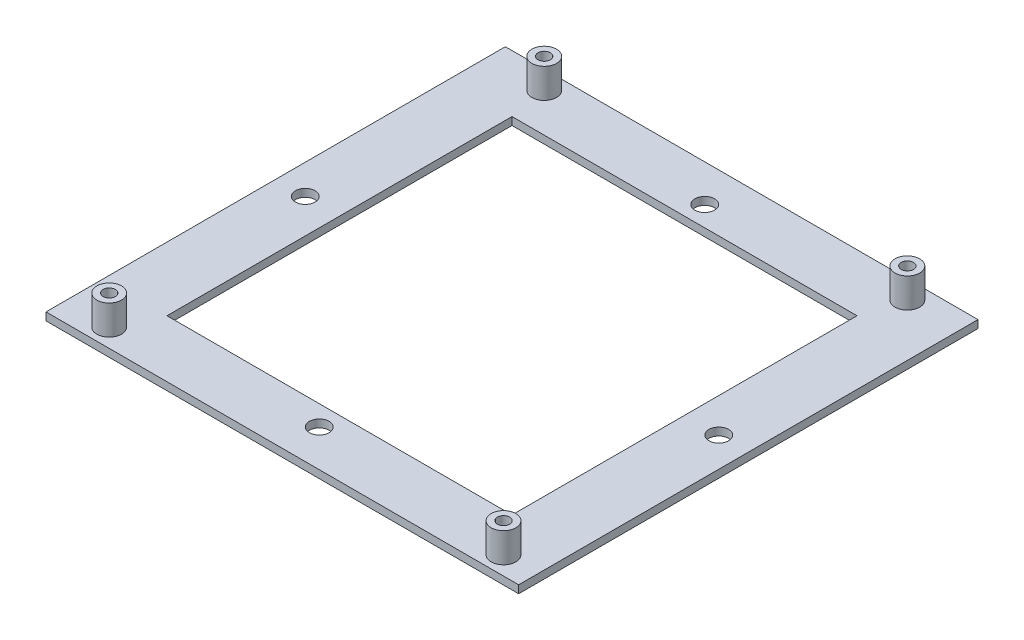
ISO-10303-21;
HEADER;
FILE_DESCRIPTION(('STEP AP214'),'2;1');
FILE_NAME('part.step','',(''),(''),'','','');
FILE_SCHEMA(('AUTOMOTIVE_DESIGN { 1 0 10303 214 1 1 1 1 }'));
ENDSEC;
DATA;
#1=APPLICATION_CONTEXT('core data for automotive mechanical design processes');
#2=APPLICATION_PROTOCOL_DEFINITION('international standard','automotive_design',2000,#1);
#3=PRODUCT_CONTEXT('',#1,'mechanical');
#4=PRODUCT('Part','Part','',(#3));
#5=PRODUCT_RELATED_PRODUCT_CATEGORY('part','',(#4));
#6=PRODUCT_DEFINITION_FORMATION('','',#4);
#7=PRODUCT_DEFINITION_CONTEXT('part definition',#1,'design');
#8=PRODUCT_DEFINITION('design','',#6,#7);
#9=PRODUCT_DEFINITION_SHAPE('','',#8);
#10=(LENGTH_UNIT() NAMED_UNIT(*) SI_UNIT(.MILLI.,.METRE.));
#11=(NAMED_UNIT(*) PLANE_ANGLE_UNIT() SI_UNIT($,.RADIAN.));
#12=(NAMED_UNIT(*) SI_UNIT($,.STERADIAN.) SOLID_ANGLE_UNIT());
#13=UNCERTAINTY_MEASURE_WITH_UNIT(LENGTH_MEASURE(1.E-05),#10,'distance_accuracy_value','');
#14=(GEOMETRIC_REPRESENTATION_CONTEXT(3) GLOBAL_UNCERTAINTY_ASSIGNED_CONTEXT((#13)) GLOBAL_UNIT_ASSIGNED_CONTEXT((#10,
#11,#12)) REPRESENTATION_CONTEXT('',''));
#15=CARTESIAN_POINT('',(0.,0.,0.));
#16=DIRECTION('',(0.,0.,1.));
#17=DIRECTION('',(1.,0.,0.));
#18=AXIS2_PLACEMENT_3D('',#15,#16,#17);
#19=CARTESIAN_POINT('',(0.,1.58,0.));
#20=DIRECTION('',(0.,-1.,0.));
#21=DIRECTION('',(0.,0.,-1.));
#22=AXIS2_PLACEMENT_3D('',#19,#20,#21);
#23=PLANE('',#22);
#24=CARTESIAN_POINT('',(41.145,1.58,42.8625));
#25=DIRECTION('',(0.,-1.,0.));
#26=DIRECTION('',(0.,0.,-1.));
#27=AXIS2_PLACEMENT_3D('',#24,#25,#26);
#28=CIRCLE('',#27,2.5);
#29=CARTESIAN_POINT('',(41.145,1.58,40.3625));
#30=VERTEX_POINT('',#29);
#31=EDGE_CURVE('E11',#30,#30,#28,.F.);
#32=ORIENTED_EDGE('',*,*,#31,.F.);
#33=EDGE_LOOP('',(#32));
#34=FACE_BOUND('',#33,.T.);
#35=CARTESIAN_POINT('',(-38.865,1.58,42.8625));
#36=DIRECTION('',(0.,-1.,0.));
#37=DIRECTION('',(0.,0.,-1.));
#38=AXIS2_PLACEMENT_3D('',#35,#36,#37);
#39=CIRCLE('',#38,2.5);
#40=CARTESIAN_POINT('',(-38.865,1.58,40.3625));
#41=VERTEX_POINT('',#40);
#42=EDGE_CURVE('E46',#41,#41,#39,.F.);
#43=ORIENTED_EDGE('',*,*,#42,.F.);
#44=EDGE_LOOP('',(#43));
#45=FACE_BOUND('',#44,.T.);
#46=CARTESIAN_POINT('',(-36.325,1.58,-42.8625));
#47=DIRECTION('',(0.,-1.,0.));
#48=DIRECTION('',(0.,0.,-1.));
#49=AXIS2_PLACEMENT_3D('',#46,#47,#48);
#50=CIRCLE('',#49,2.5);
#51=CARTESIAN_POINT('',(-36.325,1.58,-45.3625));
#52=VERTEX_POINT('',#51);
#53=EDGE_CURVE('E242',#52,#52,#50,.F.);
#54=ORIENTED_EDGE('',*,*,#53,.F.);
#55=EDGE_LOOP('',(#54));
#56=FACE_BOUND('',#55,.T.);
#57=CARTESIAN_POINT('',(37.355,1.58,-42.8635));
#58=DIRECTION('',(0.,-1.,0.));
#59=DIRECTION('',(0.,0.,-1.));
#60=AXIS2_PLACEMENT_3D('',#57,#58,#59);
#61=CIRCLE('',#60,2.5);
#62=CARTESIAN_POINT('',(37.355,1.58,-45.3635));
#63=VERTEX_POINT('',#62);
#64=EDGE_CURVE('E239',#63,#63,#61,.F.);
#65=ORIENTED_EDGE('',*,*,#64,.F.);
#66=EDGE_LOOP('',(#65));
#67=FACE_BOUND('',#66,.T.);
#68=DIRECTION('',(0.,0.,-1.));
#69=VECTOR('',#68,1.);
#70=CARTESIAN_POINT('',(47.95,1.58,46.6));
#71=LINE('',#70,#69);
#72=CARTESIAN_POINT('',(47.95,1.58,46.6));
#73=VERTEX_POINT('',#72);
#74=CARTESIAN_POINT('',(47.95,1.58,-46.6));
#75=VERTEX_POINT('',#74);
#76=EDGE_CURVE('E210',#73,#75,#71,.T.);
#77=ORIENTED_EDGE('',*,*,#76,.T.);
#78=DIRECTION('',(-1.,0.,0.));
#79=VECTOR('',#78,1.);
#80=CARTESIAN_POINT('',(-47.95,1.58,-46.6));
#81=LINE('',#80,#79);
#82=CARTESIAN_POINT('',(-47.95,1.58,-46.6));
#83=VERTEX_POINT('',#82);
#84=EDGE_CURVE('E213',#75,#83,#81,.T.);
#85=ORIENTED_EDGE('',*,*,#84,.T.);
#86=DIRECTION('',(0.,0.,1.));
#87=VECTOR('',#86,1.);
#88=CARTESIAN_POINT('',(-47.95,1.58,46.6));
#89=LINE('',#88,#87);
#90=CARTESIAN_POINT('',(-47.95,1.58,46.6));
#91=VERTEX_POINT('',#90);
#92=EDGE_CURVE('E216',#83,#91,#89,.T.);
#93=ORIENTED_EDGE('',*,*,#92,.T.);
#94=DIRECTION('',(1.,0.,0.));
#95=VECTOR('',#94,1.);
#96=CARTESIAN_POINT('',(-47.95,1.58,46.6));
#97=LINE('',#96,#95);
#98=EDGE_CURVE('E218',#91,#73,#97,.T.);
#99=ORIENTED_EDGE('',*,*,#98,.T.);
#100=EDGE_LOOP('',(#77,#85,#93,#99));
#101=FACE_BOUND('',#100,.T.);
#102=DIRECTION('',(0.,0.,-1.));
#103=VECTOR('',#102,1.);
#104=CARTESIAN_POINT('',(35.,1.58,35.));
#105=LINE('',#104,#103);
#106=CARTESIAN_POINT('',(35.,1.58,35.));
#107=VERTEX_POINT('',#106);
#108=CARTESIAN_POINT('',(35.,1.58,-35.));
#109=VERTEX_POINT('',#108);
#110=EDGE_CURVE('E184',#107,#109,#105,.T.);
#111=ORIENTED_EDGE('',*,*,#110,.F.);
#112=DIRECTION('',(1.,0.,0.));
#113=VECTOR('',#112,1.);
#114=CARTESIAN_POINT('',(-35.,1.58,35.));
#115=LINE('',#114,#113);
#116=CARTESIAN_POINT('',(-35.,1.58,35.));
#117=VERTEX_POINT('',#116);
#118=EDGE_CURVE('E191',#117,#107,#115,.T.);
#119=ORIENTED_EDGE('',*,*,#118,.F.);
#120=DIRECTION('',(0.,0.,1.));
#121=VECTOR('',#120,1.);
#122=CARTESIAN_POINT('',(-35.,1.58,35.));
#123=LINE('',#122,#121);
#124=CARTESIAN_POINT('',(-35.,1.58,-35.));
#125=VERTEX_POINT('',#124);
#126=EDGE_CURVE('E189',#125,#117,#123,.T.);
#127=ORIENTED_EDGE('',*,*,#126,.F.);
#128=DIRECTION('',(-1.,0.,0.));
#129=VECTOR('',#128,1.);
#130=CARTESIAN_POINT('',(-35.,1.58,-35.));
#131=LINE('',#130,#129);
#132=EDGE_CURVE('E186',#109,#125,#131,.T.);
#133=ORIENTED_EDGE('',*,*,#132,.F.);
#134=EDGE_LOOP('',(#111,#119,#127,#133));
#135=FACE_BOUND('',#134,.T.);
#136=CARTESIAN_POINT('',(0.,1.58,-39.1));
#137=DIRECTION('',(0.,1.,0.));
#138=DIRECTION('',(0.,0.,1.));
#139=AXIS2_PLACEMENT_3D('',#136,#137,#138);
#140=CIRCLE('',#139,2.);
#141=CARTESIAN_POINT('',(0.,1.58,-37.1));
#142=VERTEX_POINT('',#141);
#143=EDGE_CURVE('E179',#142,#142,#140,.T.);
#144=ORIENTED_EDGE('',*,*,#143,.F.);
#145=EDGE_LOOP('',(#144));
#146=FACE_BOUND('',#145,.T.);
#147=CARTESIAN_POINT('',(41.95,1.58,0.));
#148=DIRECTION('',(0.,1.,0.));
#149=DIRECTION('',(0.,0.,1.));
#150=AXIS2_PLACEMENT_3D('',#147,#148,#149);
#151=CIRCLE('',#150,2.);
#152=CARTESIAN_POINT('',(41.95,1.58,2.));
#153=VERTEX_POINT('',#152);
#154=EDGE_CURVE('E173',#153,#153,#151,.T.);
#155=ORIENTED_EDGE('',*,*,#154,.F.);
#156=EDGE_LOOP('',(#155));
#157=FACE_BOUND('',#156,.T.);
#158=CARTESIAN_POINT('',(0.,1.58,39.1));
#159=DIRECTION('',(0.,1.,0.));
#160=DIRECTION('',(0.,0.,1.));
#161=AXIS2_PLACEMENT_3D('',#158,#159,#160);
#162=CIRCLE('',#161,2.);
#163=CARTESIAN_POINT('',(0.,1.58,41.1));
#164=VERTEX_POINT('',#163);
#165=EDGE_CURVE('E167',#164,#164,#162,.T.);
#166=ORIENTED_EDGE('',*,*,#165,.F.);
#167=EDGE_LOOP('',(#166));
#168=FACE_BOUND('',#167,.T.);
#169=CARTESIAN_POINT('',(-41.95,1.58,0.));
#170=DIRECTION('',(0.,1.,0.));
#171=DIRECTION('',(0.,0.,1.));
#172=AXIS2_PLACEMENT_3D('',#169,#170,#171);
#173=CIRCLE('',#172,2.);
#174=CARTESIAN_POINT('',(-41.95,1.58,2.));
#175=VERTEX_POINT('',#174);
#176=EDGE_CURVE('E161',#175,#175,#173,.T.);
#177=ORIENTED_EDGE('',*,*,#176,.F.);
#178=EDGE_LOOP('',(#177));
#179=FACE_BOUND('',#178,.T.);
#180=ADVANCED_FACE('F38',(#34,#45,#56,#67,#101,#135,#146,#157,#168,#179),#23,.F.);
#181=CARTESIAN_POINT('',(0.,0.,0.));
#182=DIRECTION('',(0.,-1.,0.));
#183=DIRECTION('',(0.,0.,-1.));
#184=AXIS2_PLACEMENT_3D('',#181,#182,#183);
#185=PLANE('',#184);
#186=CARTESIAN_POINT('',(0.,0.,39.1));
#187=DIRECTION('',(0.,1.,0.));
#188=DIRECTION('',(0.,0.,1.));
#189=AXIS2_PLACEMENT_3D('',#186,#187,#188);
#190=CIRCLE('',#189,2.);
#191=CARTESIAN_POINT('',(0.,0.,41.1));
#192=VERTEX_POINT('',#191);
#193=EDGE_CURVE('E164',#192,#192,#190,.T.);
#194=ORIENTED_EDGE('',*,*,#193,.T.);
#195=EDGE_LOOP('',(#194));
#196=FACE_BOUND('',#195,.T.);
#197=CARTESIAN_POINT('',(0.,0.,-39.1));
#198=DIRECTION('',(0.,1.,0.));
#199=DIRECTION('',(0.,0.,1.));
#200=AXIS2_PLACEMENT_3D('',#197,#198,#199);
#201=CIRCLE('',#200,2.);
#202=CARTESIAN_POINT('',(0.,0.,-37.1));
#203=VERTEX_POINT('',#202);
#204=EDGE_CURVE('E176',#203,#203,#201,.T.);
#205=ORIENTED_EDGE('',*,*,#204,.T.);
#206=EDGE_LOOP('',(#205));
#207=FACE_BOUND('',#206,.T.);
#208=DIRECTION('',(0.,0.,-1.));
#209=VECTOR('',#208,1.);
#210=CARTESIAN_POINT('',(47.95,0.,46.6));
#211=LINE('',#210,#209);
#212=CARTESIAN_POINT('',(47.95,0.,46.6));
#213=VERTEX_POINT('',#212);
#214=CARTESIAN_POINT('',(47.95,0.,-46.6));
#215=VERTEX_POINT('',#214);
#216=EDGE_CURVE('E209',#213,#215,#211,.T.);
#217=ORIENTED_EDGE('',*,*,#216,.F.);
#218=DIRECTION('',(1.,0.,0.));
#219=VECTOR('',#218,1.);
#220=CARTESIAN_POINT('',(-47.95,0.,46.6));
#221=LINE('',#220,#219);
#222=CARTESIAN_POINT('',(-47.95,0.,46.6));
#223=VERTEX_POINT('',#222);
#224=EDGE_CURVE('E214',#223,#213,#221,.T.);
#225=ORIENTED_EDGE('',*,*,#224,.F.);
#226=DIRECTION('',(0.,0.,1.));
#227=VECTOR('',#226,1.);
#228=CARTESIAN_POINT('',(-47.95,0.,46.6));
#229=LINE('',#228,#227);
#230=CARTESIAN_POINT('',(-47.95,0.,-46.6));
#231=VERTEX_POINT('',#230);
#232=EDGE_CURVE('E225',#231,#223,#229,.T.);
#233=ORIENTED_EDGE('',*,*,#232,.F.);
#234=DIRECTION('',(-1.,0.,0.));
#235=VECTOR('',#234,1.);
#236=CARTESIAN_POINT('',(-47.95,0.,-46.6));
#237=LINE('',#236,#235);
#238=EDGE_CURVE('E223',#215,#231,#237,.T.);
#239=ORIENTED_EDGE('',*,*,#238,.F.);
#240=EDGE_LOOP('',(#217,#225,#233,#239));
#241=FACE_BOUND('',#240,.T.);
#242=DIRECTION('',(1.,0.,0.));
#243=VECTOR('',#242,1.);
#244=CARTESIAN_POINT('',(-35.,0.,35.));
#245=LINE('',#244,#243);
#246=CARTESIAN_POINT('',(-35.,0.,35.));
#247=VERTEX_POINT('',#246);
#248=CARTESIAN_POINT('',(35.,0.,35.));
#249=VERTEX_POINT('',#248);
#250=EDGE_CURVE('E187',#247,#249,#245,.T.);
#251=ORIENTED_EDGE('',*,*,#250,.T.);
#252=DIRECTION('',(0.,0.,-1.));
#253=VECTOR('',#252,1.);
#254=CARTESIAN_POINT('',(35.,0.,35.));
#255=LINE('',#254,#253);
#256=CARTESIAN_POINT('',(35.,0.,-35.));
#257=VERTEX_POINT('',#256);
#258=EDGE_CURVE('E61',#249,#257,#255,.T.);
#259=ORIENTED_EDGE('',*,*,#258,.T.);
#260=DIRECTION('',(-1.,0.,0.));
#261=VECTOR('',#260,1.);
#262=CARTESIAN_POINT('',(-35.,0.,-35.));
#263=LINE('',#262,#261);
#264=CARTESIAN_POINT('',(-35.,0.,-35.));
#265=VERTEX_POINT('',#264);
#266=EDGE_CURVE('E195',#257,#265,#263,.T.);
#267=ORIENTED_EDGE('',*,*,#266,.T.);
#268=DIRECTION('',(0.,0.,1.));
#269=VECTOR('',#268,1.);
#270=CARTESIAN_POINT('',(-35.,0.,35.));
#271=LINE('',#270,#269);
#272=EDGE_CURVE('E198',#265,#247,#271,.T.);
#273=ORIENTED_EDGE('',*,*,#272,.T.);
#274=EDGE_LOOP('',(#251,#259,#267,#273));
#275=FACE_BOUND('',#274,.T.);
#276=CARTESIAN_POINT('',(41.95,0.,0.));
#277=DIRECTION('',(0.,1.,0.));
#278=DIRECTION('',(0.,0.,1.));
#279=AXIS2_PLACEMENT_3D('',#276,#277,#278);
#280=CIRCLE('',#279,2.);
#281=CARTESIAN_POINT('',(41.95,0.,2.));
#282=VERTEX_POINT('',#281);
#283=EDGE_CURVE('E170',#282,#282,#280,.T.);
#284=ORIENTED_EDGE('',*,*,#283,.T.);
#285=EDGE_LOOP('',(#284));
#286=FACE_BOUND('',#285,.T.);
#287=CARTESIAN_POINT('',(-41.95,0.,0.));
#288=DIRECTION('',(0.,1.,0.));
#289=DIRECTION('',(0.,0.,1.));
#290=AXIS2_PLACEMENT_3D('',#287,#288,#289);
#291=CIRCLE('',#290,2.);
#292=CARTESIAN_POINT('',(-41.95,0.,2.));
#293=VERTEX_POINT('',#292);
#294=EDGE_CURVE('E160',#293,#293,#291,.T.);
#295=ORIENTED_EDGE('',*,*,#294,.T.);
#296=EDGE_LOOP('',(#295));
#297=FACE_BOUND('',#296,.T.);
#298=ADVANCED_FACE('F251',(#196,#207,#241,#275,#286,#297),#185,.T.);
#299=CARTESIAN_POINT('',(47.95,1.58,46.6));
#300=DIRECTION('',(-1.,0.,0.));
#301=DIRECTION('',(0.,0.,1.));
#302=AXIS2_PLACEMENT_3D('',#299,#300,#301);
#303=PLANE('',#302);
#304=ORIENTED_EDGE('',*,*,#216,.T.);
#305=DIRECTION('',(0.,-1.,0.));
#306=VECTOR('',#305,1.);
#307=CARTESIAN_POINT('',(47.95,1.58,-46.6));
#308=LINE('',#307,#306);
#309=EDGE_CURVE('E236',#75,#215,#308,.T.);
#310=ORIENTED_EDGE('',*,*,#309,.F.);
#311=ORIENTED_EDGE('',*,*,#76,.F.);
#312=DIRECTION('',(0.,-1.,0.));
#313=VECTOR('',#312,1.);
#314=CARTESIAN_POINT('',(47.95,1.58,46.6));
#315=LINE('',#314,#313);
#316=EDGE_CURVE('E220',#73,#213,#315,.T.);
#317=ORIENTED_EDGE('',*,*,#316,.T.);
#318=EDGE_LOOP('',(#304,#310,#311,#317));
#319=FACE_BOUND('',#318,.T.);
#320=ADVANCED_FACE('F40',(#319),#303,.F.);
#321=CARTESIAN_POINT('',(-47.95,1.58,-46.6));
#322=DIRECTION('',(0.,0.,1.));
#323=DIRECTION('',(1.,0.,0.));
#324=AXIS2_PLACEMENT_3D('',#321,#322,#323);
#325=PLANE('',#324);
#326=ORIENTED_EDGE('',*,*,#238,.T.);
#327=DIRECTION('',(0.,-1.,0.));
#328=VECTOR('',#327,1.);
#329=CARTESIAN_POINT('',(-47.95,1.58,-46.6));
#330=LINE('',#329,#328);
#331=EDGE_CURVE('E233',#83,#231,#330,.T.);
#332=ORIENTED_EDGE('',*,*,#331,.F.);
#333=ORIENTED_EDGE('',*,*,#84,.F.);
#334=ORIENTED_EDGE('',*,*,#309,.T.);
#335=EDGE_LOOP('',(#326,#332,#333,#334));
#336=FACE_BOUND('',#335,.T.);
#337=ADVANCED_FACE('F287',(#336),#325,.F.);
#338=CARTESIAN_POINT('',(-47.95,1.58,46.6));
#339=DIRECTION('',(1.,0.,0.));
#340=DIRECTION('',(0.,0.,-1.));
#341=AXIS2_PLACEMENT_3D('',#338,#339,#340);
#342=PLANE('',#341);
#343=ORIENTED_EDGE('',*,*,#232,.T.);
#344=DIRECTION('',(0.,-1.,0.));
#345=VECTOR('',#344,1.);
#346=CARTESIAN_POINT('',(-47.95,1.58,46.6));
#347=LINE('',#346,#345);
#348=EDGE_CURVE('E230',#91,#223,#347,.T.);
#349=ORIENTED_EDGE('',*,*,#348,.F.);
#350=ORIENTED_EDGE('',*,*,#92,.F.);
#351=ORIENTED_EDGE('',*,*,#331,.T.);
#352=EDGE_LOOP('',(#343,#349,#350,#351));
#353=FACE_BOUND('',#352,.T.);
#354=ADVANCED_FACE('F296',(#353),#342,.F.);
#355=CARTESIAN_POINT('',(-47.95,1.58,46.6));
#356=DIRECTION('',(0.,0.,-1.));
#357=DIRECTION('',(-1.,0.,0.));
#358=AXIS2_PLACEMENT_3D('',#355,#356,#357);
#359=PLANE('',#358);
#360=ORIENTED_EDGE('',*,*,#224,.T.);
#361=ORIENTED_EDGE('',*,*,#316,.F.);
#362=ORIENTED_EDGE('',*,*,#98,.F.);
#363=ORIENTED_EDGE('',*,*,#348,.T.);
#364=EDGE_LOOP('',(#360,#361,#362,#363));
#365=FACE_BOUND('',#364,.T.);
#366=ADVANCED_FACE('F292',(#365),#359,.F.);
#367=CARTESIAN_POINT('',(35.,1.58,35.));
#368=DIRECTION('',(-1.,0.,0.));
#369=DIRECTION('',(0.,0.,1.));
#370=AXIS2_PLACEMENT_3D('',#367,#368,#369);
#371=PLANE('',#370);
#372=ORIENTED_EDGE('',*,*,#258,.F.);
#373=DIRECTION('',(0.,-1.,0.));
#374=VECTOR('',#373,1.);
#375=CARTESIAN_POINT('',(35.,1.58,35.));
#376=LINE('',#375,#374);
#377=EDGE_CURVE('E193',#107,#249,#376,.T.);
#378=ORIENTED_EDGE('',*,*,#377,.F.);
#379=ORIENTED_EDGE('',*,*,#110,.T.);
#380=DIRECTION('',(0.,-1.,0.));
#381=VECTOR('',#380,1.);
#382=CARTESIAN_POINT('',(35.,1.58,-35.));
#383=LINE('',#382,#381);
#384=EDGE_CURVE('E207',#109,#257,#383,.T.);
#385=ORIENTED_EDGE('',*,*,#384,.T.);
#386=EDGE_LOOP('',(#372,#378,#379,#385));
#387=FACE_BOUND('',#386,.T.);
#388=ADVANCED_FACE('F295',(#387),#371,.T.);
#389=CARTESIAN_POINT('',(-35.,1.58,-35.));
#390=DIRECTION('',(0.,0.,1.));
#391=DIRECTION('',(1.,0.,0.));
#392=AXIS2_PLACEMENT_3D('',#389,#390,#391);
#393=PLANE('',#392);
#394=ORIENTED_EDGE('',*,*,#266,.F.);
#395=ORIENTED_EDGE('',*,*,#384,.F.);
#396=ORIENTED_EDGE('',*,*,#132,.T.);
#397=DIRECTION('',(0.,-1.,0.));
#398=VECTOR('',#397,1.);
#399=CARTESIAN_POINT('',(-35.,1.58,-35.));
#400=LINE('',#399,#398);
#401=EDGE_CURVE('E205',#125,#265,#400,.T.);
#402=ORIENTED_EDGE('',*,*,#401,.T.);
#403=EDGE_LOOP('',(#394,#395,#396,#402));
#404=FACE_BOUND('',#403,.T.);
#405=ADVANCED_FACE('F337',(#404),#393,.T.);
#406=CARTESIAN_POINT('',(-35.,1.58,35.));
#407=DIRECTION('',(1.,0.,0.));
#408=DIRECTION('',(0.,0.,-1.));
#409=AXIS2_PLACEMENT_3D('',#406,#407,#408);
#410=PLANE('',#409);
#411=ORIENTED_EDGE('',*,*,#272,.F.);
#412=ORIENTED_EDGE('',*,*,#401,.F.);
#413=ORIENTED_EDGE('',*,*,#126,.T.);
#414=DIRECTION('',(0.,-1.,0.));
#415=VECTOR('',#414,1.);
#416=CARTESIAN_POINT('',(-35.,1.58,35.));
#417=LINE('',#416,#415);
#418=EDGE_CURVE('E53',#117,#247,#417,.T.);
#419=ORIENTED_EDGE('',*,*,#418,.T.);
#420=EDGE_LOOP('',(#411,#412,#413,#419));
#421=FACE_BOUND('',#420,.T.);
#422=ADVANCED_FACE('F334',(#421),#410,.T.);
#423=CARTESIAN_POINT('',(-35.,1.58,35.));
#424=DIRECTION('',(0.,0.,-1.));
#425=DIRECTION('',(-1.,0.,0.));
#426=AXIS2_PLACEMENT_3D('',#423,#424,#425);
#427=PLANE('',#426);
#428=ORIENTED_EDGE('',*,*,#250,.F.);
#429=ORIENTED_EDGE('',*,*,#418,.F.);
#430=ORIENTED_EDGE('',*,*,#118,.T.);
#431=ORIENTED_EDGE('',*,*,#377,.T.);
#432=EDGE_LOOP('',(#428,#429,#430,#431));
#433=FACE_BOUND('',#432,.T.);
#434=ADVANCED_FACE('F328',(#433),#427,.T.);
#435=CARTESIAN_POINT('',(0.,1.58,-39.1));
#436=DIRECTION('',(0.,-1.,0.));
#437=DIRECTION('',(0.,0.,-1.));
#438=AXIS2_PLACEMENT_3D('',#435,#436,#437);
#439=CYLINDRICAL_SURFACE('',#438,2.);
#440=ORIENTED_EDGE('',*,*,#143,.T.);
#441=EDGE_LOOP('',(#440));
#442=FACE_BOUND('',#441,.T.);
#443=ORIENTED_EDGE('',*,*,#204,.F.);
#444=EDGE_LOOP('',(#443));
#445=FACE_BOUND('',#444,.T.);
#446=ADVANCED_FACE('F319',(#442,#445),#439,.F.);
#447=CARTESIAN_POINT('',(41.95,1.58,0.));
#448=DIRECTION('',(0.,-1.,0.));
#449=DIRECTION('',(0.,0.,-1.));
#450=AXIS2_PLACEMENT_3D('',#447,#448,#449);
#451=CYLINDRICAL_SURFACE('',#450,2.);
#452=ORIENTED_EDGE('',*,*,#154,.T.);
#453=EDGE_LOOP('',(#452));
#454=FACE_BOUND('',#453,.T.);
#455=ORIENTED_EDGE('',*,*,#283,.F.);
#456=EDGE_LOOP('',(#455));
#457=FACE_BOUND('',#456,.T.);
#458=ADVANCED_FACE('F317',(#454,#457),#451,.F.);
#459=CARTESIAN_POINT('',(0.,1.58,39.1));
#460=DIRECTION('',(0.,-1.,0.));
#461=DIRECTION('',(0.,0.,-1.));
#462=AXIS2_PLACEMENT_3D('',#459,#460,#461);
#463=CYLINDRICAL_SURFACE('',#462,2.);
#464=ORIENTED_EDGE('',*,*,#165,.T.);
#465=EDGE_LOOP('',(#464));
#466=FACE_BOUND('',#465,.T.);
#467=ORIENTED_EDGE('',*,*,#193,.F.);
#468=EDGE_LOOP('',(#467));
#469=FACE_BOUND('',#468,.T.);
#470=ADVANCED_FACE('F277',(#466,#469),#463,.F.);
#471=CARTESIAN_POINT('',(-41.95,1.58,0.));
#472=DIRECTION('',(0.,-1.,0.));
#473=DIRECTION('',(0.,0.,-1.));
#474=AXIS2_PLACEMENT_3D('',#471,#472,#473);
#475=CYLINDRICAL_SURFACE('',#474,2.);
#476=ORIENTED_EDGE('',*,*,#176,.T.);
#477=EDGE_LOOP('',(#476));
#478=FACE_BOUND('',#477,.T.);
#479=ORIENTED_EDGE('',*,*,#294,.F.);
#480=EDGE_LOOP('',(#479));
#481=FACE_BOUND('',#480,.T.);
#482=ADVANCED_FACE('F273',(#478,#481),#475,.F.);
#483=CARTESIAN_POINT('',(37.355,7.58,-42.8635));
#484=DIRECTION('',(0.,-1.,0.));
#485=DIRECTION('',(0.,0.,-1.));
#486=AXIS2_PLACEMENT_3D('',#483,#484,#485);
#487=CYLINDRICAL_SURFACE('',#486,2.5);
#488=CARTESIAN_POINT('',(37.355,7.58,-42.8635));
#489=DIRECTION('',(0.,1.,0.));
#490=DIRECTION('',(0.,0.,1.));
#491=AXIS2_PLACEMENT_3D('',#488,#489,#490);
#492=CIRCLE('',#491,2.5);
#493=CARTESIAN_POINT('',(37.355,7.58,-40.3635));
#494=VERTEX_POINT('',#493);
#495=EDGE_CURVE('E157',#494,#494,#492,.T.);
#496=ORIENTED_EDGE('',*,*,#495,.F.);
#497=EDGE_LOOP('',(#496));
#498=FACE_BOUND('',#497,.T.);
#499=ORIENTED_EDGE('',*,*,#64,.T.);
#500=EDGE_LOOP('',(#499));
#501=FACE_BOUND('',#500,.T.);
#502=ADVANCED_FACE('F276',(#498,#501),#487,.T.);
#503=CARTESIAN_POINT('',(37.355,7.58,-42.8635));
#504=DIRECTION('',(0.,1.,0.));
#505=DIRECTION('',(0.,0.,1.));
#506=AXIS2_PLACEMENT_3D('',#503,#504,#505);
#507=PLANE('',#506);
#508=CARTESIAN_POINT('',(37.355,7.58,-42.8635));
#509=DIRECTION('',(0.,1.,0.));
#510=DIRECTION('',(0.,0.,1.));
#511=AXIS2_PLACEMENT_3D('',#508,#509,#510);
#512=CIRCLE('',#511,1.24999999999999);
#513=CARTESIAN_POINT('',(37.355,7.58,-41.6135));
#514=VERTEX_POINT('',#513);
#515=EDGE_CURVE('E142',#514,#514,#512,.T.);
#516=ORIENTED_EDGE('',*,*,#515,.F.);
#517=EDGE_LOOP('',(#516));
#518=FACE_BOUND('',#517,.T.);
#519=ORIENTED_EDGE('',*,*,#495,.T.);
#520=EDGE_LOOP('',(#519));
#521=FACE_BOUND('',#520,.T.);
#522=ADVANCED_FACE('F394',(#518,#521),#507,.T.);
#523=CARTESIAN_POINT('',(-36.325,7.58,-42.8625));
#524=DIRECTION('',(0.,-1.,0.));
#525=DIRECTION('',(0.,0.,-1.));
#526=AXIS2_PLACEMENT_3D('',#523,#524,#525);
#527=CYLINDRICAL_SURFACE('',#526,2.5);
#528=CARTESIAN_POINT('',(-36.325,7.58,-42.8625));
#529=DIRECTION('',(0.,1.,0.));
#530=DIRECTION('',(0.,0.,1.));
#531=AXIS2_PLACEMENT_3D('',#528,#529,#530);
#532=CIRCLE('',#531,2.5);
#533=CARTESIAN_POINT('',(-36.325,7.58,-40.3625));
#534=VERTEX_POINT('',#533);
#535=EDGE_CURVE('E154',#534,#534,#532,.T.);
#536=ORIENTED_EDGE('',*,*,#535,.F.);
#537=EDGE_LOOP('',(#536));
#538=FACE_BOUND('',#537,.T.);
#539=ORIENTED_EDGE('',*,*,#53,.T.);
#540=EDGE_LOOP('',(#539));
#541=FACE_BOUND('',#540,.T.);
#542=ADVANCED_FACE('F402',(#538,#541),#527,.T.);
#543=CARTESIAN_POINT('',(-36.325,7.58,-42.8625));
#544=DIRECTION('',(0.,1.,0.));
#545=DIRECTION('',(0.,0.,1.));
#546=AXIS2_PLACEMENT_3D('',#543,#544,#545);
#547=PLANE('',#546);
#548=CARTESIAN_POINT('',(-36.325,7.58,-42.8625));
#549=DIRECTION('',(0.,1.,0.));
#550=DIRECTION('',(0.,0.,1.));
#551=AXIS2_PLACEMENT_3D('',#548,#549,#550);
#552=CIRCLE('',#551,1.24999999999999);
#553=CARTESIAN_POINT('',(-36.325,7.58,-41.6125));
#554=VERTEX_POINT('',#553);
#555=EDGE_CURVE('E126',#554,#554,#552,.T.);
#556=ORIENTED_EDGE('',*,*,#555,.F.);
#557=EDGE_LOOP('',(#556));
#558=FACE_BOUND('',#557,.T.);
#559=ORIENTED_EDGE('',*,*,#535,.T.);
#560=EDGE_LOOP('',(#559));
#561=FACE_BOUND('',#560,.T.);
#562=ADVANCED_FACE('F407',(#558,#561),#547,.T.);
#563=CARTESIAN_POINT('',(-38.865,7.58,42.8625));
#564=DIRECTION('',(0.,-1.,0.));
#565=DIRECTION('',(0.,0.,-1.));
#566=AXIS2_PLACEMENT_3D('',#563,#564,#565);
#567=CYLINDRICAL_SURFACE('',#566,2.5);
#568=CARTESIAN_POINT('',(-38.865,7.58,42.8625));
#569=DIRECTION('',(0.,1.,0.));
#570=DIRECTION('',(0.,0.,1.));
#571=AXIS2_PLACEMENT_3D('',#568,#569,#570);
#572=CIRCLE('',#571,2.5);
#573=CARTESIAN_POINT('',(-38.865,7.58,45.3625));
#574=VERTEX_POINT('',#573);
#575=EDGE_CURVE('E151',#574,#574,#572,.T.);
#576=ORIENTED_EDGE('',*,*,#575,.F.);
#577=EDGE_LOOP('',(#576));
#578=FACE_BOUND('',#577,.T.);
#579=ORIENTED_EDGE('',*,*,#42,.T.);
#580=EDGE_LOOP('',(#579));
#581=FACE_BOUND('',#580,.T.);
#582=ADVANCED_FACE('F247',(#578,#581),#567,.T.);
#583=CARTESIAN_POINT('',(-38.865,7.58,42.8625));
#584=DIRECTION('',(0.,1.,0.));
#585=DIRECTION('',(0.,0.,1.));
#586=AXIS2_PLACEMENT_3D('',#583,#584,#585);
#587=PLANE('',#586);
#588=CARTESIAN_POINT('',(-38.865,7.58,42.8625));
#589=DIRECTION('',(0.,1.,0.));
#590=DIRECTION('',(0.,0.,1.));
#591=AXIS2_PLACEMENT_3D('',#588,#589,#590);
#592=CIRCLE('',#591,1.24999999999999);
#593=CARTESIAN_POINT('',(-38.865,7.58,44.1125));
#594=VERTEX_POINT('',#593);
#595=EDGE_CURVE('E125',#594,#594,#592,.T.);
#596=ORIENTED_EDGE('',*,*,#595,.F.);
#597=EDGE_LOOP('',(#596));
#598=FACE_BOUND('',#597,.T.);
#599=ORIENTED_EDGE('',*,*,#575,.T.);
#600=EDGE_LOOP('',(#599));
#601=FACE_BOUND('',#600,.T.);
#602=ADVANCED_FACE('F419',(#598,#601),#587,.T.);
#603=CARTESIAN_POINT('',(41.145,7.58,42.8625));
#604=DIRECTION('',(0.,-1.,0.));
#605=DIRECTION('',(0.,0.,-1.));
#606=AXIS2_PLACEMENT_3D('',#603,#604,#605);
#607=CYLINDRICAL_SURFACE('',#606,2.5);
#608=CARTESIAN_POINT('',(41.145,7.58,42.8625));
#609=DIRECTION('',(0.,1.,0.));
#610=DIRECTION('',(0.,0.,1.));
#611=AXIS2_PLACEMENT_3D('',#608,#609,#610);
#612=CIRCLE('',#611,2.5);
#613=CARTESIAN_POINT('',(41.145,7.58,45.3625));
#614=VERTEX_POINT('',#613);
#615=EDGE_CURVE('E148',#614,#614,#612,.T.);
#616=ORIENTED_EDGE('',*,*,#615,.F.);
#617=EDGE_LOOP('',(#616));
#618=FACE_BOUND('',#617,.T.);
#619=ORIENTED_EDGE('',*,*,#31,.T.);
#620=EDGE_LOOP('',(#619));
#621=FACE_BOUND('',#620,.T.);
#622=ADVANCED_FACE('F427',(#618,#621),#607,.T.);
#623=CARTESIAN_POINT('',(41.145,7.58,42.8625));
#624=DIRECTION('',(0.,1.,0.));
#625=DIRECTION('',(0.,0.,1.));
#626=AXIS2_PLACEMENT_3D('',#623,#624,#625);
#627=PLANE('',#626);
#628=CARTESIAN_POINT('',(41.145,7.58,42.8625));
#629=DIRECTION('',(0.,1.,0.));
#630=DIRECTION('',(0.,0.,1.));
#631=AXIS2_PLACEMENT_3D('',#628,#629,#630);
#632=CIRCLE('',#631,1.24999999999999);
#633=CARTESIAN_POINT('',(41.145,7.58,44.1125));
#634=VERTEX_POINT('',#633);
#635=EDGE_CURVE('E136',#634,#634,#632,.T.);
#636=ORIENTED_EDGE('',*,*,#635,.F.);
#637=EDGE_LOOP('',(#636));
#638=FACE_BOUND('',#637,.T.);
#639=ORIENTED_EDGE('',*,*,#615,.T.);
#640=EDGE_LOOP('',(#639));
#641=FACE_BOUND('',#640,.T.);
#642=ADVANCED_FACE('F432',(#638,#641),#627,.T.);
#643=CARTESIAN_POINT('',(37.355,1.57999999999999,-42.8635));
#644=DIRECTION('',(0.,1.,0.));
#645=DIRECTION('',(0.,0.,1.));
#646=AXIS2_PLACEMENT_3D('',#643,#644,#645);
#647=CONICAL_SURFACE('',#646,1.24999999999999,1.02974425867665);
#648=CARTESIAN_POINT('',(37.355,0.828924226215552,-42.8635));
#649=VERTEX_POINT('',#648);
#650=VERTEX_LOOP('',#649);
#651=FACE_BOUND('',#650,.T.);
#652=CARTESIAN_POINT('',(37.355,1.57999999999999,-42.8635));
#653=DIRECTION('',(0.,1.,0.));
#654=DIRECTION('',(0.,0.,1.));
#655=AXIS2_PLACEMENT_3D('',#652,#653,#654);
#656=CIRCLE('',#655,1.24999999999999);
#657=CARTESIAN_POINT('',(37.355,1.57999999999999,-41.6135));
#658=VERTEX_POINT('',#657);
#659=EDGE_CURVE('E145',#658,#658,#656,.T.);
#660=ORIENTED_EDGE('',*,*,#659,.T.);
#661=EDGE_LOOP('',(#660));
#662=FACE_BOUND('',#661,.T.);
#663=ADVANCED_FACE('F471',(#651,#662),#647,.F.);
#664=CARTESIAN_POINT('',(37.355,7.58,-42.8635));
#665=DIRECTION('',(0.,1.,0.));
#666=DIRECTION('',(0.,0.,1.));
#667=AXIS2_PLACEMENT_3D('',#664,#665,#666);
#668=CYLINDRICAL_SURFACE('',#667,1.24999999999999);
#669=ORIENTED_EDGE('',*,*,#659,.F.);
#670=EDGE_LOOP('',(#669));
#671=FACE_BOUND('',#670,.T.);
#672=ORIENTED_EDGE('',*,*,#515,.T.);
#673=EDGE_LOOP('',(#672));
#674=FACE_BOUND('',#673,.T.);
#675=ADVANCED_FACE('F481',(#671,#674),#668,.F.);
#676=CARTESIAN_POINT('',(41.145,1.57999999999999,42.8625));
#677=DIRECTION('',(0.,1.,0.));
#678=DIRECTION('',(0.,0.,1.));
#679=AXIS2_PLACEMENT_3D('',#676,#677,#678);
#680=CONICAL_SURFACE('',#679,1.24999999999999,1.02974425867665);
#681=CARTESIAN_POINT('',(41.145,0.828924226215552,42.8625));
#682=VERTEX_POINT('',#681);
#683=VERTEX_LOOP('',#682);
#684=FACE_BOUND('',#683,.T.);
#685=CARTESIAN_POINT('',(41.145,1.57999999999999,42.8625));
#686=DIRECTION('',(0.,1.,0.));
#687=DIRECTION('',(0.,0.,1.));
#688=AXIS2_PLACEMENT_3D('',#685,#686,#687);
#689=CIRCLE('',#688,1.24999999999999);
#690=CARTESIAN_POINT('',(41.145,1.57999999999999,44.1125));
#691=VERTEX_POINT('',#690);
#692=EDGE_CURVE('E139',#691,#691,#689,.T.);
#693=ORIENTED_EDGE('',*,*,#692,.T.);
#694=EDGE_LOOP('',(#693));
#695=FACE_BOUND('',#694,.T.);
#696=ADVANCED_FACE('F492',(#684,#695),#680,.F.);
#697=CARTESIAN_POINT('',(41.145,7.58,42.8625));
#698=DIRECTION('',(0.,1.,0.));
#699=DIRECTION('',(0.,0.,1.));
#700=AXIS2_PLACEMENT_3D('',#697,#698,#699);
#701=CYLINDRICAL_SURFACE('',#700,1.24999999999999);
#702=ORIENTED_EDGE('',*,*,#692,.F.);
#703=EDGE_LOOP('',(#702));
#704=FACE_BOUND('',#703,.T.);
#705=ORIENTED_EDGE('',*,*,#635,.T.);
#706=EDGE_LOOP('',(#705));
#707=FACE_BOUND('',#706,.T.);
#708=ADVANCED_FACE('F503',(#704,#707),#701,.F.);
#709=CARTESIAN_POINT('',(-38.865,1.57999999999999,42.8625));
#710=DIRECTION('',(0.,1.,0.));
#711=DIRECTION('',(0.,0.,1.));
#712=AXIS2_PLACEMENT_3D('',#709,#710,#711);
#713=CONICAL_SURFACE('',#712,1.24999999999999,1.02974425867665);
#714=CARTESIAN_POINT('',(-38.865,0.828924226215552,42.8625));
#715=VERTEX_POINT('',#714);
#716=VERTEX_LOOP('',#715);
#717=FACE_BOUND('',#716,.T.);
#718=CARTESIAN_POINT('',(-38.865,1.57999999999999,42.8625));
#719=DIRECTION('',(0.,1.,0.));
#720=DIRECTION('',(0.,0.,1.));
#721=AXIS2_PLACEMENT_3D('',#718,#719,#720);
#722=CIRCLE('',#721,1.24999999999999);
#723=CARTESIAN_POINT('',(-38.865,1.57999999999999,44.1125));
#724=VERTEX_POINT('',#723);
#725=EDGE_CURVE('E129',#724,#724,#722,.T.);
#726=ORIENTED_EDGE('',*,*,#725,.T.);
#727=EDGE_LOOP('',(#726));
#728=FACE_BOUND('',#727,.T.);
#729=ADVANCED_FACE('F513',(#717,#728),#713,.F.);
#730=CARTESIAN_POINT('',(-38.865,7.58,42.8625));
#731=DIRECTION('',(0.,1.,0.));
#732=DIRECTION('',(0.,0.,1.));
#733=AXIS2_PLACEMENT_3D('',#730,#731,#732);
#734=CYLINDRICAL_SURFACE('',#733,1.24999999999999);
#735=ORIENTED_EDGE('',*,*,#725,.F.);
#736=EDGE_LOOP('',(#735));
#737=FACE_BOUND('',#736,.T.);
#738=ORIENTED_EDGE('',*,*,#595,.T.);
#739=EDGE_LOOP('',(#738));
#740=FACE_BOUND('',#739,.T.);
#741=ADVANCED_FACE('F119',(#737,#740),#734,.F.);
#742=CARTESIAN_POINT('',(-36.325,1.57999999999999,-42.8625));
#743=DIRECTION('',(0.,1.,0.));
#744=DIRECTION('',(0.,0.,1.));
#745=AXIS2_PLACEMENT_3D('',#742,#743,#744);
#746=CONICAL_SURFACE('',#745,1.24999999999999,1.02974425867665);
#747=CARTESIAN_POINT('',(-36.325,0.828924226215552,-42.8625));
#748=VERTEX_POINT('',#747);
#749=VERTEX_LOOP('',#748);
#750=FACE_BOUND('',#749,.T.);
#751=CARTESIAN_POINT('',(-36.325,1.57999999999999,-42.8625));
#752=DIRECTION('',(0.,1.,0.));
#753=DIRECTION('',(0.,0.,1.));
#754=AXIS2_PLACEMENT_3D('',#751,#752,#753);
#755=CIRCLE('',#754,1.24999999999999);
#756=CARTESIAN_POINT('',(-36.325,1.57999999999999,-41.6125));
#757=VERTEX_POINT('',#756);
#758=EDGE_CURVE('E123',#757,#757,#755,.T.);
#759=ORIENTED_EDGE('',*,*,#758,.T.);
#760=EDGE_LOOP('',(#759));
#761=FACE_BOUND('',#760,.T.);
#762=ADVANCED_FACE('F115',(#750,#761),#746,.F.);
#763=CARTESIAN_POINT('',(-36.325,7.58,-42.8625));
#764=DIRECTION('',(0.,1.,0.));
#765=DIRECTION('',(0.,0.,1.));
#766=AXIS2_PLACEMENT_3D('',#763,#764,#765);
#767=CYLINDRICAL_SURFACE('',#766,1.24999999999999);
#768=ORIENTED_EDGE('',*,*,#758,.F.);
#769=EDGE_LOOP('',(#768));
#770=FACE_BOUND('',#769,.T.);
#771=ORIENTED_EDGE('',*,*,#555,.T.);
#772=EDGE_LOOP('',(#771));
#773=FACE_BOUND('',#772,.T.);
#774=ADVANCED_FACE('F118',(#770,#773),#767,.F.);
#775=CLOSED_SHELL('',(#180,#298,#320,#337,#354,#366,#388,#405,#422,#434,#446,#458,#470,#482,
#502,#522,#542,#562,#582,#602,#622,#642,#663,#675,#696,#708,#729,#741,#762,#774));
#776=MANIFOLD_SOLID_BREP('B2',#775);
#777=ADVANCED_BREP_SHAPE_REPRESENTATION('',(#18,#776),#14);
#778=SHAPE_DEFINITION_REPRESENTATION(#9,#777);
ENDSEC;
END-ISO-10303-21;
